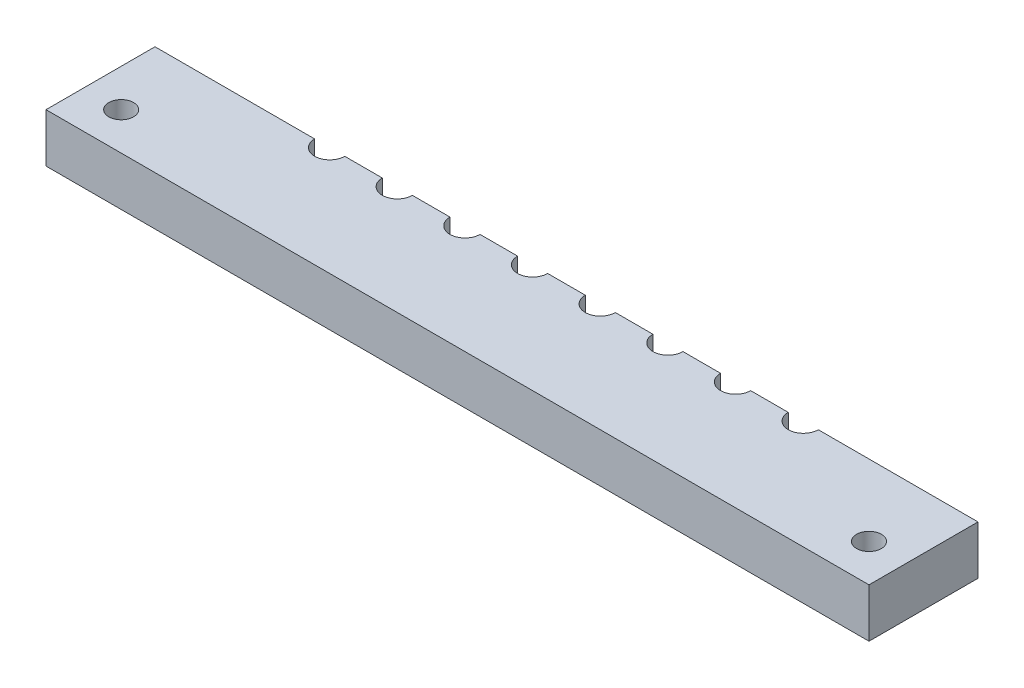
ISO-10303-21;
HEADER;
FILE_DESCRIPTION(('STEP AP214'),'2;1');
FILE_NAME('part.step','',(''),(''),'','','');
FILE_SCHEMA(('AUTOMOTIVE_DESIGN { 1 0 10303 214 1 1 1 1 }'));
ENDSEC;
DATA;
#1=APPLICATION_CONTEXT('core data for automotive mechanical design processes');
#2=APPLICATION_PROTOCOL_DEFINITION('international standard','automotive_design',2000,#1);
#3=PRODUCT_CONTEXT('',#1,'mechanical');
#4=PRODUCT('Part','Part','',(#3));
#5=PRODUCT_RELATED_PRODUCT_CATEGORY('part','',(#4));
#6=PRODUCT_DEFINITION_FORMATION('','',#4);
#7=PRODUCT_DEFINITION_CONTEXT('part definition',#1,'design');
#8=PRODUCT_DEFINITION('design','',#6,#7);
#9=PRODUCT_DEFINITION_SHAPE('','',#8);
#10=(LENGTH_UNIT() NAMED_UNIT(*) SI_UNIT(.MILLI.,.METRE.));
#11=(NAMED_UNIT(*) PLANE_ANGLE_UNIT() SI_UNIT($,.RADIAN.));
#12=(NAMED_UNIT(*) SI_UNIT($,.STERADIAN.) SOLID_ANGLE_UNIT());
#13=UNCERTAINTY_MEASURE_WITH_UNIT(LENGTH_MEASURE(1.E-05),#10,'distance_accuracy_value','');
#14=(GEOMETRIC_REPRESENTATION_CONTEXT(3) GLOBAL_UNCERTAINTY_ASSIGNED_CONTEXT((#13)) GLOBAL_UNIT_ASSIGNED_CONTEXT((#10,
#11,#12)) REPRESENTATION_CONTEXT('',''));
#15=CARTESIAN_POINT('',(0.,0.,0.));
#16=DIRECTION('',(0.,0.,1.));
#17=DIRECTION('',(1.,0.,0.));
#18=AXIS2_PLACEMENT_3D('',#15,#16,#17);
#19=CARTESIAN_POINT('',(0.,0.,0.));
#20=DIRECTION('',(0.,0.,1.));
#21=DIRECTION('',(1.,0.,0.));
#22=AXIS2_PLACEMENT_3D('',#19,#20,#21);
#23=PLANE('',#22);
#24=DIRECTION('',(-1.,0.,0.));
#25=VECTOR('',#24,1.);
#26=CARTESIAN_POINT('',(0.,-22.175,0.));
#27=LINE('',#26,#25);
#28=CARTESIAN_POINT('',(-34.225,-22.175,0.));
#29=VERTEX_POINT('',#28);
#30=CARTESIAN_POINT('',(-54.74,-22.175,0.));
#31=VERTEX_POINT('',#30);
#32=EDGE_CURVE('E326',#29,#31,#27,.T.);
#33=ORIENTED_EDGE('',*,*,#32,.T.);
#34=DIRECTION('',(0.,1.,0.));
#35=VECTOR('',#34,1.);
#36=CARTESIAN_POINT('',(-54.74,0.,0.));
#37=LINE('',#36,#35);
#38=CARTESIAN_POINT('',(-54.74,-15.675,0.));
#39=VERTEX_POINT('',#38);
#40=EDGE_CURVE('E38',#31,#39,#37,.T.);
#41=ORIENTED_EDGE('',*,*,#40,.T.);
#42=DIRECTION('',(1.,0.,0.));
#43=VECTOR('',#42,1.);
#44=CARTESIAN_POINT('',(0.,-15.675,0.));
#45=LINE('',#44,#43);
#46=CARTESIAN_POINT('',(-33.5,-15.675,0.));
#47=VERTEX_POINT('',#46);
#48=EDGE_CURVE('E45',#39,#47,#45,.T.);
#49=ORIENTED_EDGE('',*,*,#48,.T.);
#50=DIRECTION('',(0.,1.,0.));
#51=VECTOR('',#50,1.);
#52=CARTESIAN_POINT('',(-33.5,22.175,0.));
#53=LINE('',#52,#51);
#54=CARTESIAN_POINT('',(-33.5,-20.675,0.));
#55=VERTEX_POINT('',#54);
#56=EDGE_CURVE('E304',#55,#47,#53,.T.);
#57=ORIENTED_EDGE('',*,*,#56,.F.);
#58=DIRECTION('',(1.,0.,0.));
#59=VECTOR('',#58,1.);
#60=CARTESIAN_POINT('',(-34.225,-20.675,0.));
#61=LINE('',#60,#59);
#62=CARTESIAN_POINT('',(-34.225,-20.675,0.));
#63=VERTEX_POINT('',#62);
#64=EDGE_CURVE('E399',#63,#55,#61,.T.);
#65=ORIENTED_EDGE('',*,*,#64,.F.);
#66=DIRECTION('',(0.,1.,0.));
#67=VECTOR('',#66,1.);
#68=CARTESIAN_POINT('',(-34.225,22.175,0.));
#69=LINE('',#68,#67);
#70=EDGE_CURVE('E401',#29,#63,#69,.T.);
#71=ORIENTED_EDGE('',*,*,#70,.F.);
#72=EDGE_LOOP('',(#33,#41,#49,#57,#65,#71));
#73=FACE_BOUND('',#72,.T.);
#74=ADVANCED_FACE('F34',(#73),#23,.F.);
#75=CARTESIAN_POINT('',(-25.225,-22.175,0.));
#76=VERTEX_POINT('',#75);
#77=CARTESIAN_POINT('',(-28.775,-22.175,0.));
#78=VERTEX_POINT('',#77);
#79=EDGE_CURVE('E329',#76,#78,#27,.T.);
#80=ORIENTED_EDGE('',*,*,#79,.T.);
#81=DIRECTION('',(0.,1.,0.));
#82=VECTOR('',#81,1.);
#83=CARTESIAN_POINT('',(-28.775,22.175,0.));
#84=LINE('',#83,#82);
#85=CARTESIAN_POINT('',(-28.775,-20.675,0.));
#86=VERTEX_POINT('',#85);
#87=EDGE_CURVE('E402',#86,#78,#84,.F.);
#88=ORIENTED_EDGE('',*,*,#87,.F.);
#89=CARTESIAN_POINT('',(-29.5,-20.675,0.));
#90=VERTEX_POINT('',#89);
#91=EDGE_CURVE('E398',#90,#86,#61,.T.);
#92=ORIENTED_EDGE('',*,*,#91,.F.);
#93=DIRECTION('',(0.,1.,0.));
#94=VECTOR('',#93,1.);
#95=CARTESIAN_POINT('',(-29.5,22.175,0.));
#96=LINE('',#95,#94);
#97=CARTESIAN_POINT('',(-29.5,-15.675,0.));
#98=VERTEX_POINT('',#97);
#99=EDGE_CURVE('E396',#98,#90,#96,.F.);
#100=ORIENTED_EDGE('',*,*,#99,.F.);
#101=CARTESIAN_POINT('',(-24.5,-15.675,0.));
#102=VERTEX_POINT('',#101);
#103=EDGE_CURVE('E599',#98,#102,#45,.T.);
#104=ORIENTED_EDGE('',*,*,#103,.T.);
#105=DIRECTION('',(0.,1.,0.));
#106=VECTOR('',#105,1.);
#107=CARTESIAN_POINT('',(-24.5,22.175,0.));
#108=LINE('',#107,#106);
#109=CARTESIAN_POINT('',(-24.5,-20.675,0.));
#110=VERTEX_POINT('',#109);
#111=EDGE_CURVE('E388',#110,#102,#108,.T.);
#112=ORIENTED_EDGE('',*,*,#111,.F.);
#113=DIRECTION('',(1.,0.,0.));
#114=VECTOR('',#113,1.);
#115=CARTESIAN_POINT('',(-25.225,-20.675,0.));
#116=LINE('',#115,#114);
#117=CARTESIAN_POINT('',(-25.225,-20.675,0.));
#118=VERTEX_POINT('',#117);
#119=EDGE_CURVE('E389',#118,#110,#116,.T.);
#120=ORIENTED_EDGE('',*,*,#119,.F.);
#121=DIRECTION('',(0.,1.,0.));
#122=VECTOR('',#121,1.);
#123=CARTESIAN_POINT('',(-25.225,22.175,0.));
#124=LINE('',#123,#122);
#125=EDGE_CURVE('E391',#76,#118,#124,.T.);
#126=ORIENTED_EDGE('',*,*,#125,.F.);
#127=EDGE_LOOP('',(#80,#88,#92,#100,#104,#112,#120,#126));
#128=FACE_BOUND('',#127,.T.);
#129=ADVANCED_FACE('F530',(#128),#23,.F.);
#130=CARTESIAN_POINT('',(-16.225,-22.175,0.));
#131=VERTEX_POINT('',#130);
#132=CARTESIAN_POINT('',(-19.775,-22.175,0.));
#133=VERTEX_POINT('',#132);
#134=EDGE_CURVE('E546',#131,#133,#27,.T.);
#135=ORIENTED_EDGE('',*,*,#134,.T.);
#136=DIRECTION('',(0.,1.,0.));
#137=VECTOR('',#136,1.);
#138=CARTESIAN_POINT('',(-19.775,22.175,0.));
#139=LINE('',#138,#137);
#140=CARTESIAN_POINT('',(-19.775,-20.675,0.));
#141=VERTEX_POINT('',#140);
#142=EDGE_CURVE('E392',#141,#133,#139,.F.);
#143=ORIENTED_EDGE('',*,*,#142,.F.);
#144=CARTESIAN_POINT('',(-20.5,-20.675,0.));
#145=VERTEX_POINT('',#144);
#146=EDGE_CURVE('E387',#145,#141,#116,.T.);
#147=ORIENTED_EDGE('',*,*,#146,.F.);
#148=DIRECTION('',(0.,1.,0.));
#149=VECTOR('',#148,1.);
#150=CARTESIAN_POINT('',(-20.5,22.175,0.));
#151=LINE('',#150,#149);
#152=CARTESIAN_POINT('',(-20.5,-15.675,0.));
#153=VERTEX_POINT('',#152);
#154=EDGE_CURVE('E385',#153,#145,#151,.F.);
#155=ORIENTED_EDGE('',*,*,#154,.F.);
#156=CARTESIAN_POINT('',(-15.5,-15.675,0.));
#157=VERTEX_POINT('',#156);
#158=EDGE_CURVE('E595',#153,#157,#45,.T.);
#159=ORIENTED_EDGE('',*,*,#158,.T.);
#160=DIRECTION('',(0.,1.,0.));
#161=VECTOR('',#160,1.);
#162=CARTESIAN_POINT('',(-15.5,22.175,0.));
#163=LINE('',#162,#161);
#164=CARTESIAN_POINT('',(-15.5,-20.675,0.));
#165=VERTEX_POINT('',#164);
#166=EDGE_CURVE('E377',#165,#157,#163,.T.);
#167=ORIENTED_EDGE('',*,*,#166,.F.);
#168=DIRECTION('',(1.,0.,0.));
#169=VECTOR('',#168,1.);
#170=CARTESIAN_POINT('',(-16.225,-20.675,0.));
#171=LINE('',#170,#169);
#172=CARTESIAN_POINT('',(-16.225,-20.675,0.));
#173=VERTEX_POINT('',#172);
#174=EDGE_CURVE('E378',#173,#165,#171,.T.);
#175=ORIENTED_EDGE('',*,*,#174,.F.);
#176=DIRECTION('',(0.,1.,0.));
#177=VECTOR('',#176,1.);
#178=CARTESIAN_POINT('',(-16.225,22.175,0.));
#179=LINE('',#178,#177);
#180=EDGE_CURVE('E380',#131,#173,#179,.T.);
#181=ORIENTED_EDGE('',*,*,#180,.F.);
#182=EDGE_LOOP('',(#135,#143,#147,#155,#159,#167,#175,#181));
#183=FACE_BOUND('',#182,.T.);
#184=ADVANCED_FACE('F534',(#183),#23,.F.);
#185=CARTESIAN_POINT('',(-7.225,-22.175,0.));
#186=VERTEX_POINT('',#185);
#187=CARTESIAN_POINT('',(-10.775,-22.175,0.));
#188=VERTEX_POINT('',#187);
#189=EDGE_CURVE('E570',#186,#188,#27,.T.);
#190=ORIENTED_EDGE('',*,*,#189,.T.);
#191=DIRECTION('',(0.,1.,0.));
#192=VECTOR('',#191,1.);
#193=CARTESIAN_POINT('',(-10.775,22.175,0.));
#194=LINE('',#193,#192);
#195=CARTESIAN_POINT('',(-10.775,-20.675,0.));
#196=VERTEX_POINT('',#195);
#197=EDGE_CURVE('E381',#196,#188,#194,.F.);
#198=ORIENTED_EDGE('',*,*,#197,.F.);
#199=CARTESIAN_POINT('',(-11.5,-20.675,0.));
#200=VERTEX_POINT('',#199);
#201=EDGE_CURVE('E376',#200,#196,#171,.T.);
#202=ORIENTED_EDGE('',*,*,#201,.F.);
#203=DIRECTION('',(0.,1.,0.));
#204=VECTOR('',#203,1.);
#205=CARTESIAN_POINT('',(-11.5,22.175,0.));
#206=LINE('',#205,#204);
#207=CARTESIAN_POINT('',(-11.5,-15.675,0.));
#208=VERTEX_POINT('',#207);
#209=EDGE_CURVE('E374',#208,#200,#206,.F.);
#210=ORIENTED_EDGE('',*,*,#209,.F.);
#211=CARTESIAN_POINT('',(-6.5,-15.675,0.));
#212=VERTEX_POINT('',#211);
#213=EDGE_CURVE('E602',#208,#212,#45,.T.);
#214=ORIENTED_EDGE('',*,*,#213,.T.);
#215=DIRECTION('',(0.,1.,0.));
#216=VECTOR('',#215,1.);
#217=CARTESIAN_POINT('',(-6.50000000000002,22.175,0.));
#218=LINE('',#217,#216);
#219=CARTESIAN_POINT('',(-6.50000000000001,-20.675,0.));
#220=VERTEX_POINT('',#219);
#221=EDGE_CURVE('E366',#220,#212,#218,.T.);
#222=ORIENTED_EDGE('',*,*,#221,.F.);
#223=DIRECTION('',(1.,0.,0.));
#224=VECTOR('',#223,1.);
#225=CARTESIAN_POINT('',(-7.225,-20.675,0.));
#226=LINE('',#225,#224);
#227=CARTESIAN_POINT('',(-7.225,-20.675,0.));
#228=VERTEX_POINT('',#227);
#229=EDGE_CURVE('E367',#228,#220,#226,.T.);
#230=ORIENTED_EDGE('',*,*,#229,.F.);
#231=DIRECTION('',(0.,1.,0.));
#232=VECTOR('',#231,1.);
#233=CARTESIAN_POINT('',(-7.22500000000002,22.175,0.));
#234=LINE('',#233,#232);
#235=EDGE_CURVE('E369',#186,#228,#234,.T.);
#236=ORIENTED_EDGE('',*,*,#235,.F.);
#237=EDGE_LOOP('',(#190,#198,#202,#210,#214,#222,#230,#236));
#238=FACE_BOUND('',#237,.T.);
#239=ADVANCED_FACE('F539',(#238),#23,.F.);
#240=CARTESIAN_POINT('',(1.775,-22.175,0.));
#241=VERTEX_POINT('',#240);
#242=CARTESIAN_POINT('',(-1.77499999999999,-22.175,0.));
#243=VERTEX_POINT('',#242);
#244=EDGE_CURVE('E565',#241,#243,#27,.T.);
#245=ORIENTED_EDGE('',*,*,#244,.T.);
#246=DIRECTION('',(0.,1.,0.));
#247=VECTOR('',#246,1.);
#248=CARTESIAN_POINT('',(-1.77500000000001,22.175,0.));
#249=LINE('',#248,#247);
#250=CARTESIAN_POINT('',(-1.77499999999999,-20.675,0.));
#251=VERTEX_POINT('',#250);
#252=EDGE_CURVE('E370',#251,#243,#249,.F.);
#253=ORIENTED_EDGE('',*,*,#252,.F.);
#254=CARTESIAN_POINT('',(-2.49999999999998,-20.675,0.));
#255=VERTEX_POINT('',#254);
#256=EDGE_CURVE('E365',#255,#251,#226,.T.);
#257=ORIENTED_EDGE('',*,*,#256,.F.);
#258=DIRECTION('',(0.,1.,0.));
#259=VECTOR('',#258,1.);
#260=CARTESIAN_POINT('',(-2.50000000000002,22.175,0.));
#261=LINE('',#260,#259);
#262=CARTESIAN_POINT('',(-2.5,-15.675,0.));
#263=VERTEX_POINT('',#262);
#264=EDGE_CURVE('E363',#263,#255,#261,.F.);
#265=ORIENTED_EDGE('',*,*,#264,.F.);
#266=CARTESIAN_POINT('',(2.5,-15.675,0.));
#267=VERTEX_POINT('',#266);
#268=EDGE_CURVE('E604',#263,#267,#45,.T.);
#269=ORIENTED_EDGE('',*,*,#268,.T.);
#270=DIRECTION('',(0.,1.,0.));
#271=VECTOR('',#270,1.);
#272=CARTESIAN_POINT('',(2.49999999999998,22.175,0.));
#273=LINE('',#272,#271);
#274=CARTESIAN_POINT('',(2.49999999999999,-20.675,0.));
#275=VERTEX_POINT('',#274);
#276=EDGE_CURVE('E355',#275,#267,#273,.T.);
#277=ORIENTED_EDGE('',*,*,#276,.F.);
#278=DIRECTION('',(1.,0.,0.));
#279=VECTOR('',#278,1.);
#280=CARTESIAN_POINT('',(1.775,-20.675,0.));
#281=LINE('',#280,#279);
#282=CARTESIAN_POINT('',(1.775,-20.675,0.));
#283=VERTEX_POINT('',#282);
#284=EDGE_CURVE('E356',#283,#275,#281,.T.);
#285=ORIENTED_EDGE('',*,*,#284,.F.);
#286=DIRECTION('',(0.,1.,0.));
#287=VECTOR('',#286,1.);
#288=CARTESIAN_POINT('',(1.77499999999998,22.175,0.));
#289=LINE('',#288,#287);
#290=EDGE_CURVE('E358',#241,#283,#289,.T.);
#291=ORIENTED_EDGE('',*,*,#290,.F.);
#292=EDGE_LOOP('',(#245,#253,#257,#265,#269,#277,#285,#291));
#293=FACE_BOUND('',#292,.T.);
#294=ADVANCED_FACE('F833',(#293),#23,.F.);
#295=CARTESIAN_POINT('',(10.775,-22.175,0.));
#296=VERTEX_POINT('',#295);
#297=CARTESIAN_POINT('',(7.22500000000001,-22.175,0.));
#298=VERTEX_POINT('',#297);
#299=EDGE_CURVE('E560',#296,#298,#27,.T.);
#300=ORIENTED_EDGE('',*,*,#299,.T.);
#301=DIRECTION('',(0.,1.,0.));
#302=VECTOR('',#301,1.);
#303=CARTESIAN_POINT('',(7.22499999999999,22.175,0.));
#304=LINE('',#303,#302);
#305=CARTESIAN_POINT('',(7.22500000000001,-20.675,0.));
#306=VERTEX_POINT('',#305);
#307=EDGE_CURVE('E359',#306,#298,#304,.F.);
#308=ORIENTED_EDGE('',*,*,#307,.F.);
#309=CARTESIAN_POINT('',(6.50000000000002,-20.675,0.));
#310=VERTEX_POINT('',#309);
#311=EDGE_CURVE('E354',#310,#306,#281,.T.);
#312=ORIENTED_EDGE('',*,*,#311,.F.);
#313=DIRECTION('',(0.,1.,0.));
#314=VECTOR('',#313,1.);
#315=CARTESIAN_POINT('',(6.49999999999998,22.175,0.));
#316=LINE('',#315,#314);
#317=CARTESIAN_POINT('',(6.5,-15.675,0.));
#318=VERTEX_POINT('',#317);
#319=EDGE_CURVE('E352',#318,#310,#316,.F.);
#320=ORIENTED_EDGE('',*,*,#319,.F.);
#321=CARTESIAN_POINT('',(11.5,-15.675,0.));
#322=VERTEX_POINT('',#321);
#323=EDGE_CURVE('E1031',#318,#322,#45,.T.);
#324=ORIENTED_EDGE('',*,*,#323,.T.);
#325=DIRECTION('',(0.,1.,0.));
#326=VECTOR('',#325,1.);
#327=CARTESIAN_POINT('',(11.5,22.175,0.));
#328=LINE('',#327,#326);
#329=CARTESIAN_POINT('',(11.5,-20.675,0.));
#330=VERTEX_POINT('',#329);
#331=EDGE_CURVE('E344',#330,#322,#328,.T.);
#332=ORIENTED_EDGE('',*,*,#331,.F.);
#333=DIRECTION('',(1.,0.,0.));
#334=VECTOR('',#333,1.);
#335=CARTESIAN_POINT('',(10.775,-20.675,0.));
#336=LINE('',#335,#334);
#337=CARTESIAN_POINT('',(10.775,-20.675,0.));
#338=VERTEX_POINT('',#337);
#339=EDGE_CURVE('E345',#338,#330,#336,.T.);
#340=ORIENTED_EDGE('',*,*,#339,.F.);
#341=DIRECTION('',(0.,1.,0.));
#342=VECTOR('',#341,1.);
#343=CARTESIAN_POINT('',(10.775,22.175,0.));
#344=LINE('',#343,#342);
#345=EDGE_CURVE('E347',#296,#338,#344,.T.);
#346=ORIENTED_EDGE('',*,*,#345,.F.);
#347=EDGE_LOOP('',(#300,#308,#312,#320,#324,#332,#340,#346));
#348=FACE_BOUND('',#347,.T.);
#349=ADVANCED_FACE('F825',(#348),#23,.F.);
#350=CARTESIAN_POINT('',(19.775,-22.175,0.));
#351=VERTEX_POINT('',#350);
#352=CARTESIAN_POINT('',(16.225,-22.175,0.));
#353=VERTEX_POINT('',#352);
#354=EDGE_CURVE('E556',#351,#353,#27,.T.);
#355=ORIENTED_EDGE('',*,*,#354,.T.);
#356=DIRECTION('',(0.,1.,0.));
#357=VECTOR('',#356,1.);
#358=CARTESIAN_POINT('',(16.225,22.175,0.));
#359=LINE('',#358,#357);
#360=CARTESIAN_POINT('',(16.225,-20.675,0.));
#361=VERTEX_POINT('',#360);
#362=EDGE_CURVE('E348',#361,#353,#359,.F.);
#363=ORIENTED_EDGE('',*,*,#362,.F.);
#364=CARTESIAN_POINT('',(15.5,-20.675,0.));
#365=VERTEX_POINT('',#364);
#366=EDGE_CURVE('E343',#365,#361,#336,.T.);
#367=ORIENTED_EDGE('',*,*,#366,.F.);
#368=DIRECTION('',(0.,1.,0.));
#369=VECTOR('',#368,1.);
#370=CARTESIAN_POINT('',(15.5,22.175,0.));
#371=LINE('',#370,#369);
#372=CARTESIAN_POINT('',(15.5,-15.675,0.));
#373=VERTEX_POINT('',#372);
#374=EDGE_CURVE('E341',#373,#365,#371,.F.);
#375=ORIENTED_EDGE('',*,*,#374,.F.);
#376=CARTESIAN_POINT('',(20.5,-15.675,0.));
#377=VERTEX_POINT('',#376);
#378=EDGE_CURVE('E1029',#373,#377,#45,.T.);
#379=ORIENTED_EDGE('',*,*,#378,.T.);
#380=DIRECTION('',(0.,1.,0.));
#381=VECTOR('',#380,1.);
#382=CARTESIAN_POINT('',(20.5,22.175,0.));
#383=LINE('',#382,#381);
#384=CARTESIAN_POINT('',(20.5,-20.675,0.));
#385=VERTEX_POINT('',#384);
#386=EDGE_CURVE('E333',#385,#377,#383,.T.);
#387=ORIENTED_EDGE('',*,*,#386,.F.);
#388=DIRECTION('',(1.,0.,0.));
#389=VECTOR('',#388,1.);
#390=CARTESIAN_POINT('',(19.775,-20.675,0.));
#391=LINE('',#390,#389);
#392=CARTESIAN_POINT('',(19.775,-20.675,0.));
#393=VERTEX_POINT('',#392);
#394=EDGE_CURVE('E334',#393,#385,#391,.T.);
#395=ORIENTED_EDGE('',*,*,#394,.F.);
#396=DIRECTION('',(0.,1.,0.));
#397=VECTOR('',#396,1.);
#398=CARTESIAN_POINT('',(19.775,22.175,0.));
#399=LINE('',#398,#397);
#400=EDGE_CURVE('E336',#351,#393,#399,.T.);
#401=ORIENTED_EDGE('',*,*,#400,.F.);
#402=EDGE_LOOP('',(#355,#363,#367,#375,#379,#387,#395,#401));
#403=FACE_BOUND('',#402,.T.);
#404=ADVANCED_FACE('F817',(#403),#23,.F.);
#405=CARTESIAN_POINT('',(28.775,-22.175,0.));
#406=VERTEX_POINT('',#405);
#407=CARTESIAN_POINT('',(25.225,-22.175,0.));
#408=VERTEX_POINT('',#407);
#409=EDGE_CURVE('E554',#406,#408,#27,.T.);
#410=ORIENTED_EDGE('',*,*,#409,.T.);
#411=DIRECTION('',(0.,1.,0.));
#412=VECTOR('',#411,1.);
#413=CARTESIAN_POINT('',(25.225,22.175,0.));
#414=LINE('',#413,#412);
#415=CARTESIAN_POINT('',(25.225,-20.675,0.));
#416=VERTEX_POINT('',#415);
#417=EDGE_CURVE('E337',#416,#408,#414,.F.);
#418=ORIENTED_EDGE('',*,*,#417,.F.);
#419=CARTESIAN_POINT('',(24.5,-20.675,0.));
#420=VERTEX_POINT('',#419);
#421=EDGE_CURVE('E332',#420,#416,#391,.T.);
#422=ORIENTED_EDGE('',*,*,#421,.F.);
#423=DIRECTION('',(0.,1.,0.));
#424=VECTOR('',#423,1.);
#425=CARTESIAN_POINT('',(24.5,22.175,0.));
#426=LINE('',#425,#424);
#427=CARTESIAN_POINT('',(24.5,-15.675,0.));
#428=VERTEX_POINT('',#427);
#429=EDGE_CURVE('E330',#428,#420,#426,.F.);
#430=ORIENTED_EDGE('',*,*,#429,.F.);
#431=CARTESIAN_POINT('',(29.5,-15.675,0.));
#432=VERTEX_POINT('',#431);
#433=EDGE_CURVE('E43',#428,#432,#45,.T.);
#434=ORIENTED_EDGE('',*,*,#433,.T.);
#435=DIRECTION('',(0.,1.,0.));
#436=VECTOR('',#435,1.);
#437=CARTESIAN_POINT('',(29.5,22.175,0.));
#438=LINE('',#437,#436);
#439=CARTESIAN_POINT('',(29.5,-20.675,0.));
#440=VERTEX_POINT('',#439);
#441=EDGE_CURVE('E318',#440,#432,#438,.T.);
#442=ORIENTED_EDGE('',*,*,#441,.F.);
#443=DIRECTION('',(1.,0.,0.));
#444=VECTOR('',#443,1.);
#445=CARTESIAN_POINT('',(28.775,-20.675,0.));
#446=LINE('',#445,#444);
#447=CARTESIAN_POINT('',(28.775,-20.675,0.));
#448=VERTEX_POINT('',#447);
#449=EDGE_CURVE('E319',#448,#440,#446,.T.);
#450=ORIENTED_EDGE('',*,*,#449,.F.);
#451=DIRECTION('',(0.,1.,0.));
#452=VECTOR('',#451,1.);
#453=CARTESIAN_POINT('',(28.775,22.175,0.));
#454=LINE('',#453,#452);
#455=EDGE_CURVE('E321',#406,#448,#454,.T.);
#456=ORIENTED_EDGE('',*,*,#455,.F.);
#457=EDGE_LOOP('',(#410,#418,#422,#430,#434,#442,#450,#456));
#458=FACE_BOUND('',#457,.T.);
#459=ADVANCED_FACE('F527',(#458),#23,.F.);
#460=CARTESIAN_POINT('',(54.74,-22.175,0.));
#461=VERTEX_POINT('',#460);
#462=CARTESIAN_POINT('',(34.225,-22.175,0.));
#463=VERTEX_POINT('',#462);
#464=EDGE_CURVE('E325',#461,#463,#27,.T.);
#465=ORIENTED_EDGE('',*,*,#464,.T.);
#466=DIRECTION('',(0.,1.,0.));
#467=VECTOR('',#466,1.);
#468=CARTESIAN_POINT('',(34.225,22.175,0.));
#469=LINE('',#468,#467);
#470=CARTESIAN_POINT('',(34.225,-20.675,0.));
#471=VERTEX_POINT('',#470);
#472=EDGE_CURVE('E322',#471,#463,#469,.F.);
#473=ORIENTED_EDGE('',*,*,#472,.F.);
#474=CARTESIAN_POINT('',(33.5,-20.675,0.));
#475=VERTEX_POINT('',#474);
#476=EDGE_CURVE('E317',#475,#471,#446,.T.);
#477=ORIENTED_EDGE('',*,*,#476,.F.);
#478=DIRECTION('',(0.,1.,0.));
#479=VECTOR('',#478,1.);
#480=CARTESIAN_POINT('',(33.5,22.175,0.));
#481=LINE('',#480,#479);
#482=CARTESIAN_POINT('',(33.5,-15.675,0.));
#483=VERTEX_POINT('',#482);
#484=EDGE_CURVE('E315',#483,#475,#481,.F.);
#485=ORIENTED_EDGE('',*,*,#484,.F.);
#486=CARTESIAN_POINT('',(54.74,-15.675,0.));
#487=VERTEX_POINT('',#486);
#488=EDGE_CURVE('E11',#483,#487,#45,.T.);
#489=ORIENTED_EDGE('',*,*,#488,.T.);
#490=DIRECTION('',(0.,1.,0.));
#491=VECTOR('',#490,1.);
#492=CARTESIAN_POINT('',(54.74,0.,0.));
#493=LINE('',#492,#491);
#494=EDGE_CURVE('E59',#461,#487,#493,.T.);
#495=ORIENTED_EDGE('',*,*,#494,.F.);
#496=EDGE_LOOP('',(#465,#473,#477,#485,#489,#495));
#497=FACE_BOUND('',#496,.T.);
#498=ADVANCED_FACE('F36',(#497),#23,.F.);
#499=CARTESIAN_POINT('',(0.,-22.175,14.5));
#500=DIRECTION('',(0.,-1.,0.));
#501=DIRECTION('',(1.,0.,0.));
#502=AXIS2_PLACEMENT_3D('',#499,#500,#501);
#503=PLANE('',#502);
#504=ORIENTED_EDGE('',*,*,#464,.F.);
#505=DIRECTION('',(0.,0.,-1.));
#506=VECTOR('',#505,1.);
#507=CARTESIAN_POINT('',(54.74,-22.175,14.5));
#508=LINE('',#507,#506);
#509=CARTESIAN_POINT('',(54.74,-22.175,14.5));
#510=VERTEX_POINT('',#509);
#511=EDGE_CURVE('E299',#510,#461,#508,.T.);
#512=ORIENTED_EDGE('',*,*,#511,.F.);
#513=DIRECTION('',(-1.,0.,0.));
#514=VECTOR('',#513,1.);
#515=CARTESIAN_POINT('',(0.,-22.175,14.5));
#516=LINE('',#515,#514);
#517=CARTESIAN_POINT('',(-54.74,-22.175,14.5));
#518=VERTEX_POINT('',#517);
#519=EDGE_CURVE('E288',#510,#518,#516,.T.);
#520=ORIENTED_EDGE('',*,*,#519,.T.);
#521=DIRECTION('',(0.,0.,-1.));
#522=VECTOR('',#521,1.);
#523=CARTESIAN_POINT('',(-54.74,-22.175,14.5));
#524=LINE('',#523,#522);
#525=EDGE_CURVE('E301',#518,#31,#524,.T.);
#526=ORIENTED_EDGE('',*,*,#525,.T.);
#527=ORIENTED_EDGE('',*,*,#32,.F.);
#528=CARTESIAN_POINT('',(-31.5,-22.175,0.));
#529=DIRECTION('',(0.,1.,0.));
#530=DIRECTION('',(-1.,0.,0.));
#531=AXIS2_PLACEMENT_3D('',#528,#529,#530);
#532=CIRCLE('',#531,2.725);
#533=EDGE_CURVE('E290',#29,#78,#532,.T.);
#534=ORIENTED_EDGE('',*,*,#533,.T.);
#535=ORIENTED_EDGE('',*,*,#79,.F.);
#536=CARTESIAN_POINT('',(-22.5,-22.175,0.));
#537=DIRECTION('',(0.,1.,0.));
#538=DIRECTION('',(-1.,0.,0.));
#539=AXIS2_PLACEMENT_3D('',#536,#537,#538);
#540=CIRCLE('',#539,2.725);
#541=EDGE_CURVE('E422',#76,#133,#540,.T.);
#542=ORIENTED_EDGE('',*,*,#541,.T.);
#543=ORIENTED_EDGE('',*,*,#134,.F.);
#544=CARTESIAN_POINT('',(-13.5,-22.175,0.));
#545=DIRECTION('',(0.,1.,0.));
#546=DIRECTION('',(-1.,0.,0.));
#547=AXIS2_PLACEMENT_3D('',#544,#545,#546);
#548=CIRCLE('',#547,2.725);
#549=EDGE_CURVE('E433',#131,#188,#548,.T.);
#550=ORIENTED_EDGE('',*,*,#549,.T.);
#551=ORIENTED_EDGE('',*,*,#189,.F.);
#552=CARTESIAN_POINT('',(-4.5,-22.175,0.));
#553=DIRECTION('',(0.,1.,0.));
#554=DIRECTION('',(-1.,0.,0.));
#555=AXIS2_PLACEMENT_3D('',#552,#553,#554);
#556=CIRCLE('',#555,2.725);
#557=EDGE_CURVE('E442',#186,#243,#556,.T.);
#558=ORIENTED_EDGE('',*,*,#557,.T.);
#559=ORIENTED_EDGE('',*,*,#244,.F.);
#560=CARTESIAN_POINT('',(4.5,-22.175,0.));
#561=DIRECTION('',(0.,1.,0.));
#562=DIRECTION('',(-1.,0.,0.));
#563=AXIS2_PLACEMENT_3D('',#560,#561,#562);
#564=CIRCLE('',#563,2.725);
#565=EDGE_CURVE('E451',#241,#298,#564,.T.);
#566=ORIENTED_EDGE('',*,*,#565,.T.);
#567=ORIENTED_EDGE('',*,*,#299,.F.);
#568=CARTESIAN_POINT('',(13.5,-22.175,0.));
#569=DIRECTION('',(0.,1.,0.));
#570=DIRECTION('',(-1.,0.,0.));
#571=AXIS2_PLACEMENT_3D('',#568,#569,#570);
#572=CIRCLE('',#571,2.725);
#573=EDGE_CURVE('E460',#296,#353,#572,.T.);
#574=ORIENTED_EDGE('',*,*,#573,.T.);
#575=ORIENTED_EDGE('',*,*,#354,.F.);
#576=CARTESIAN_POINT('',(22.5,-22.175,0.));
#577=DIRECTION('',(0.,1.,0.));
#578=DIRECTION('',(-1.,0.,0.));
#579=AXIS2_PLACEMENT_3D('',#576,#577,#578);
#580=CIRCLE('',#579,2.725);
#581=EDGE_CURVE('E469',#351,#408,#580,.T.);
#582=ORIENTED_EDGE('',*,*,#581,.T.);
#583=ORIENTED_EDGE('',*,*,#409,.F.);
#584=CARTESIAN_POINT('',(31.5,-22.175,0.));
#585=DIRECTION('',(0.,1.,0.));
#586=DIRECTION('',(-1.,0.,0.));
#587=AXIS2_PLACEMENT_3D('',#584,#585,#586);
#588=CIRCLE('',#587,2.725);
#589=EDGE_CURVE('E478',#406,#463,#588,.T.);
#590=ORIENTED_EDGE('',*,*,#589,.T.);
#591=EDGE_LOOP('',(#504,#512,#520,#526,#527,#534,#535,#542,#543,#550,#551,#558,#559,#566,#567,
#574,#575,#582,#583,#590));
#592=FACE_BOUND('',#591,.T.);
#593=CARTESIAN_POINT('',(49.74,-22.175,9.5));
#594=DIRECTION('',(0.,1.,0.));
#595=DIRECTION('',(-1.,0.,0.));
#596=AXIS2_PLACEMENT_3D('',#593,#594,#595);
#597=CIRCLE('',#596,1.65);
#598=CARTESIAN_POINT('',(48.09,-22.175,9.5));
#599=VERTEX_POINT('',#598);
#600=EDGE_CURVE('E312',#599,#599,#597,.T.);
#601=ORIENTED_EDGE('',*,*,#600,.T.);
#602=EDGE_LOOP('',(#601));
#603=FACE_BOUND('',#602,.T.);
#604=CARTESIAN_POINT('',(-49.74,-22.175,9.5));
#605=DIRECTION('',(0.,1.,0.));
#606=DIRECTION('',(1.,0.,0.));
#607=AXIS2_PLACEMENT_3D('',#604,#605,#606);
#608=CIRCLE('',#607,1.65);
#609=CARTESIAN_POINT('',(-48.09,-22.175,9.5));
#610=VERTEX_POINT('',#609);
#611=EDGE_CURVE('E507',#610,#610,#608,.T.);
#612=ORIENTED_EDGE('',*,*,#611,.T.);
#613=EDGE_LOOP('',(#612));
#614=FACE_BOUND('',#613,.T.);
#615=ADVANCED_FACE('F513',(#592,#603,#614),#503,.T.);
#616=CARTESIAN_POINT('',(0.,0.,14.5));
#617=DIRECTION('',(0.,0.,1.));
#618=DIRECTION('',(1.,0.,0.));
#619=AXIS2_PLACEMENT_3D('',#616,#617,#618);
#620=PLANE('',#619);
#621=DIRECTION('',(0.,1.,0.));
#622=VECTOR('',#621,1.);
#623=CARTESIAN_POINT('',(54.74,0.,14.5));
#624=LINE('',#623,#622);
#625=CARTESIAN_POINT('',(54.74,-15.675,14.5));
#626=VERTEX_POINT('',#625);
#627=EDGE_CURVE('E283',#510,#626,#624,.T.);
#628=ORIENTED_EDGE('',*,*,#627,.T.);
#629=DIRECTION('',(1.,0.,0.));
#630=VECTOR('',#629,1.);
#631=CARTESIAN_POINT('',(0.,-15.675,14.5));
#632=LINE('',#631,#630);
#633=CARTESIAN_POINT('',(-54.74,-15.675,14.5));
#634=VERTEX_POINT('',#633);
#635=EDGE_CURVE('E269',#634,#626,#632,.T.);
#636=ORIENTED_EDGE('',*,*,#635,.F.);
#637=DIRECTION('',(0.,1.,0.));
#638=VECTOR('',#637,1.);
#639=CARTESIAN_POINT('',(-54.74,0.,14.5));
#640=LINE('',#639,#638);
#641=EDGE_CURVE('E289',#518,#634,#640,.T.);
#642=ORIENTED_EDGE('',*,*,#641,.F.);
#643=ORIENTED_EDGE('',*,*,#519,.F.);
#644=EDGE_LOOP('',(#628,#636,#642,#643));
#645=FACE_BOUND('',#644,.T.);
#646=ADVANCED_FACE('F286',(#645),#620,.T.);
#647=CARTESIAN_POINT('',(-54.74,0.,14.5));
#648=DIRECTION('',(-1.,0.,0.));
#649=DIRECTION('',(0.,0.,1.));
#650=AXIS2_PLACEMENT_3D('',#647,#648,#649);
#651=PLANE('',#650);
#652=ORIENTED_EDGE('',*,*,#40,.F.);
#653=ORIENTED_EDGE('',*,*,#525,.F.);
#654=ORIENTED_EDGE('',*,*,#641,.T.);
#655=DIRECTION('',(0.,0.,-1.));
#656=VECTOR('',#655,1.);
#657=CARTESIAN_POINT('',(-54.74,-15.675,14.5));
#658=LINE('',#657,#656);
#659=EDGE_CURVE('E274',#634,#39,#658,.T.);
#660=ORIENTED_EDGE('',*,*,#659,.T.);
#661=EDGE_LOOP('',(#652,#653,#654,#660));
#662=FACE_BOUND('',#661,.T.);
#663=ADVANCED_FACE('F549',(#662),#651,.T.);
#664=CARTESIAN_POINT('',(54.74,0.,14.5));
#665=DIRECTION('',(-1.,0.,0.));
#666=DIRECTION('',(0.,0.,1.));
#667=AXIS2_PLACEMENT_3D('',#664,#665,#666);
#668=PLANE('',#667);
#669=ORIENTED_EDGE('',*,*,#511,.T.);
#670=ORIENTED_EDGE('',*,*,#494,.T.);
#671=DIRECTION('',(0.,0.,-1.));
#672=VECTOR('',#671,1.);
#673=CARTESIAN_POINT('',(54.74,-15.675,14.5));
#674=LINE('',#673,#672);
#675=EDGE_CURVE('E272',#626,#487,#674,.T.);
#676=ORIENTED_EDGE('',*,*,#675,.F.);
#677=ORIENTED_EDGE('',*,*,#627,.F.);
#678=EDGE_LOOP('',(#669,#670,#676,#677));
#679=FACE_BOUND('',#678,.T.);
#680=ADVANCED_FACE('F282',(#679),#668,.F.);
#681=CARTESIAN_POINT('',(31.5,22.175,0.));
#682=DIRECTION('',(0.,1.,0.));
#683=DIRECTION('',(-1.,0.,0.));
#684=AXIS2_PLACEMENT_3D('',#681,#682,#683);
#685=CYLINDRICAL_SURFACE('',#684,2.725);
#686=CARTESIAN_POINT('',(31.5,-20.675,0.));
#687=DIRECTION('',(0.,1.,0.));
#688=DIRECTION('',(-1.,0.,0.));
#689=AXIS2_PLACEMENT_3D('',#686,#687,#688);
#690=CIRCLE('',#689,2.725);
#691=EDGE_CURVE('E481',#448,#471,#690,.T.);
#692=ORIENTED_EDGE('',*,*,#691,.T.);
#693=ORIENTED_EDGE('',*,*,#472,.T.);
#694=ORIENTED_EDGE('',*,*,#589,.F.);
#695=ORIENTED_EDGE('',*,*,#455,.T.);
#696=EDGE_LOOP('',(#692,#693,#694,#695));
#697=FACE_BOUND('',#696,.T.);
#698=ADVANCED_FACE('F627',(#697),#685,.F.);
#699=CARTESIAN_POINT('',(28.775,-20.675,0.));
#700=DIRECTION('',(0.,1.,0.));
#701=DIRECTION('',(-1.,0.,0.));
#702=AXIS2_PLACEMENT_3D('',#699,#700,#701);
#703=PLANE('',#702);
#704=ORIENTED_EDGE('',*,*,#691,.F.);
#705=ORIENTED_EDGE('',*,*,#449,.T.);
#706=CARTESIAN_POINT('',(31.5,-20.675,0.));
#707=DIRECTION('',(0.,1.,0.));
#708=DIRECTION('',(-1.,0.,0.));
#709=AXIS2_PLACEMENT_3D('',#706,#707,#708);
#710=CIRCLE('',#709,2.00000000000001);
#711=EDGE_CURVE('E484',#440,#475,#710,.T.);
#712=ORIENTED_EDGE('',*,*,#711,.T.);
#713=ORIENTED_EDGE('',*,*,#476,.T.);
#714=EDGE_LOOP('',(#704,#705,#712,#713));
#715=FACE_BOUND('',#714,.T.);
#716=ADVANCED_FACE('F631',(#715),#703,.F.);
#717=CARTESIAN_POINT('',(31.5,22.175,0.));
#718=DIRECTION('',(0.,1.,0.));
#719=DIRECTION('',(-1.,0.,0.));
#720=AXIS2_PLACEMENT_3D('',#717,#718,#719);
#721=CYLINDRICAL_SURFACE('',#720,2.);
#722=CARTESIAN_POINT('',(31.5,-15.675,0.));
#723=DIRECTION('',(0.,1.,0.));
#724=DIRECTION('',(0.,0.,1.));
#725=AXIS2_PLACEMENT_3D('',#722,#723,#724);
#726=CIRCLE('',#725,2.);
#727=EDGE_CURVE('E305',#483,#432,#726,.F.);
#728=ORIENTED_EDGE('',*,*,#727,.F.);
#729=ORIENTED_EDGE('',*,*,#484,.T.);
#730=ORIENTED_EDGE('',*,*,#711,.F.);
#731=ORIENTED_EDGE('',*,*,#441,.T.);
#732=EDGE_LOOP('',(#728,#729,#730,#731));
#733=FACE_BOUND('',#732,.T.);
#734=ADVANCED_FACE('F637',(#733),#721,.F.);
#735=CARTESIAN_POINT('',(22.5,22.175,0.));
#736=DIRECTION('',(0.,1.,0.));
#737=DIRECTION('',(-1.,0.,0.));
#738=AXIS2_PLACEMENT_3D('',#735,#736,#737);
#739=CYLINDRICAL_SURFACE('',#738,2.725);
#740=CARTESIAN_POINT('',(22.5,-20.675,0.));
#741=DIRECTION('',(0.,1.,0.));
#742=DIRECTION('',(-1.,0.,0.));
#743=AXIS2_PLACEMENT_3D('',#740,#741,#742);
#744=CIRCLE('',#743,2.725);
#745=EDGE_CURVE('E472',#393,#416,#744,.T.);
#746=ORIENTED_EDGE('',*,*,#745,.T.);
#747=ORIENTED_EDGE('',*,*,#417,.T.);
#748=ORIENTED_EDGE('',*,*,#581,.F.);
#749=ORIENTED_EDGE('',*,*,#400,.T.);
#750=EDGE_LOOP('',(#746,#747,#748,#749));
#751=FACE_BOUND('',#750,.T.);
#752=ADVANCED_FACE('F650',(#751),#739,.F.);
#753=CARTESIAN_POINT('',(19.775,-20.675,0.));
#754=DIRECTION('',(0.,1.,0.));
#755=DIRECTION('',(-1.,0.,0.));
#756=AXIS2_PLACEMENT_3D('',#753,#754,#755);
#757=PLANE('',#756);
#758=ORIENTED_EDGE('',*,*,#745,.F.);
#759=ORIENTED_EDGE('',*,*,#394,.T.);
#760=CARTESIAN_POINT('',(22.5,-20.675,0.));
#761=DIRECTION('',(0.,1.,0.));
#762=DIRECTION('',(-1.,0.,0.));
#763=AXIS2_PLACEMENT_3D('',#760,#761,#762);
#764=CIRCLE('',#763,2.00000000000001);
#765=EDGE_CURVE('E475',#385,#420,#764,.T.);
#766=ORIENTED_EDGE('',*,*,#765,.T.);
#767=ORIENTED_EDGE('',*,*,#421,.T.);
#768=EDGE_LOOP('',(#758,#759,#766,#767));
#769=FACE_BOUND('',#768,.T.);
#770=ADVANCED_FACE('F646',(#769),#757,.F.);
#771=CARTESIAN_POINT('',(22.5,22.175,0.));
#772=DIRECTION('',(0.,1.,0.));
#773=DIRECTION('',(-1.,0.,0.));
#774=AXIS2_PLACEMENT_3D('',#771,#772,#773);
#775=CYLINDRICAL_SURFACE('',#774,2.);
#776=CARTESIAN_POINT('',(22.5,-15.675,0.));
#777=DIRECTION('',(0.,1.,0.));
#778=DIRECTION('',(0.,0.,1.));
#779=AXIS2_PLACEMENT_3D('',#776,#777,#778);
#780=CIRCLE('',#779,2.);
#781=EDGE_CURVE('E308',#428,#377,#780,.F.);
#782=ORIENTED_EDGE('',*,*,#781,.F.);
#783=ORIENTED_EDGE('',*,*,#429,.T.);
#784=ORIENTED_EDGE('',*,*,#765,.F.);
#785=ORIENTED_EDGE('',*,*,#386,.T.);
#786=EDGE_LOOP('',(#782,#783,#784,#785));
#787=FACE_BOUND('',#786,.T.);
#788=ADVANCED_FACE('F642',(#787),#775,.F.);
#789=CARTESIAN_POINT('',(13.5,22.175,0.));
#790=DIRECTION('',(0.,1.,0.));
#791=DIRECTION('',(-1.,0.,0.));
#792=AXIS2_PLACEMENT_3D('',#789,#790,#791);
#793=CYLINDRICAL_SURFACE('',#792,2.725);
#794=CARTESIAN_POINT('',(13.5,-20.675,0.));
#795=DIRECTION('',(0.,1.,0.));
#796=DIRECTION('',(-1.,0.,0.));
#797=AXIS2_PLACEMENT_3D('',#794,#795,#796);
#798=CIRCLE('',#797,2.725);
#799=EDGE_CURVE('E463',#338,#361,#798,.T.);
#800=ORIENTED_EDGE('',*,*,#799,.T.);
#801=ORIENTED_EDGE('',*,*,#362,.T.);
#802=ORIENTED_EDGE('',*,*,#573,.F.);
#803=ORIENTED_EDGE('',*,*,#345,.T.);
#804=EDGE_LOOP('',(#800,#801,#802,#803));
#805=FACE_BOUND('',#804,.T.);
#806=ADVANCED_FACE('F645',(#805),#793,.F.);
#807=CARTESIAN_POINT('',(10.775,-20.675,0.));
#808=DIRECTION('',(0.,1.,0.));
#809=DIRECTION('',(-1.,0.,0.));
#810=AXIS2_PLACEMENT_3D('',#807,#808,#809);
#811=PLANE('',#810);
#812=ORIENTED_EDGE('',*,*,#799,.F.);
#813=ORIENTED_EDGE('',*,*,#339,.T.);
#814=CARTESIAN_POINT('',(13.5,-20.675,0.));
#815=DIRECTION('',(0.,1.,0.));
#816=DIRECTION('',(-1.,0.,0.));
#817=AXIS2_PLACEMENT_3D('',#814,#815,#816);
#818=CIRCLE('',#817,2.00000000000001);
#819=EDGE_CURVE('E466',#330,#365,#818,.T.);
#820=ORIENTED_EDGE('',*,*,#819,.T.);
#821=ORIENTED_EDGE('',*,*,#366,.T.);
#822=EDGE_LOOP('',(#812,#813,#820,#821));
#823=FACE_BOUND('',#822,.T.);
#824=ADVANCED_FACE('F659',(#823),#811,.F.);
#825=CARTESIAN_POINT('',(13.5,22.175,0.));
#826=DIRECTION('',(0.,1.,0.));
#827=DIRECTION('',(-1.,0.,0.));
#828=AXIS2_PLACEMENT_3D('',#825,#826,#827);
#829=CYLINDRICAL_SURFACE('',#828,2.);
#830=CARTESIAN_POINT('',(13.5,-15.675,0.));
#831=DIRECTION('',(0.,1.,0.));
#832=DIRECTION('',(0.,0.,1.));
#833=AXIS2_PLACEMENT_3D('',#830,#831,#832);
#834=CIRCLE('',#833,2.);
#835=EDGE_CURVE('E501',#373,#322,#834,.F.);
#836=ORIENTED_EDGE('',*,*,#835,.F.);
#837=ORIENTED_EDGE('',*,*,#374,.T.);
#838=ORIENTED_EDGE('',*,*,#819,.F.);
#839=ORIENTED_EDGE('',*,*,#331,.T.);
#840=EDGE_LOOP('',(#836,#837,#838,#839));
#841=FACE_BOUND('',#840,.T.);
#842=ADVANCED_FACE('F655',(#841),#829,.F.);
#843=CARTESIAN_POINT('',(4.49999999999998,22.175,0.));
#844=DIRECTION('',(0.,1.,0.));
#845=DIRECTION('',(-1.,0.,0.));
#846=AXIS2_PLACEMENT_3D('',#843,#844,#845);
#847=CYLINDRICAL_SURFACE('',#846,2.725);
#848=CARTESIAN_POINT('',(4.5,-20.675,0.));
#849=DIRECTION('',(0.,1.,0.));
#850=DIRECTION('',(-1.,0.,0.));
#851=AXIS2_PLACEMENT_3D('',#848,#849,#850);
#852=CIRCLE('',#851,2.725);
#853=EDGE_CURVE('E454',#283,#306,#852,.T.);
#854=ORIENTED_EDGE('',*,*,#853,.T.);
#855=ORIENTED_EDGE('',*,*,#307,.T.);
#856=ORIENTED_EDGE('',*,*,#565,.F.);
#857=ORIENTED_EDGE('',*,*,#290,.T.);
#858=EDGE_LOOP('',(#854,#855,#856,#857));
#859=FACE_BOUND('',#858,.T.);
#860=ADVANCED_FACE('F658',(#859),#847,.F.);
#861=CARTESIAN_POINT('',(1.775,-20.675,0.));
#862=DIRECTION('',(0.,1.,0.));
#863=DIRECTION('',(-1.,0.,0.));
#864=AXIS2_PLACEMENT_3D('',#861,#862,#863);
#865=PLANE('',#864);
#866=ORIENTED_EDGE('',*,*,#853,.F.);
#867=ORIENTED_EDGE('',*,*,#284,.T.);
#868=CARTESIAN_POINT('',(4.5,-20.675,0.));
#869=DIRECTION('',(0.,1.,0.));
#870=DIRECTION('',(-1.,0.,0.));
#871=AXIS2_PLACEMENT_3D('',#868,#869,#870);
#872=CIRCLE('',#871,2.00000000000001);
#873=EDGE_CURVE('E457',#275,#310,#872,.T.);
#874=ORIENTED_EDGE('',*,*,#873,.T.);
#875=ORIENTED_EDGE('',*,*,#311,.T.);
#876=EDGE_LOOP('',(#866,#867,#874,#875));
#877=FACE_BOUND('',#876,.T.);
#878=ADVANCED_FACE('F671',(#877),#865,.F.);
#879=CARTESIAN_POINT('',(4.49999999999998,22.175,0.));
#880=DIRECTION('',(0.,1.,0.));
#881=DIRECTION('',(-1.,0.,0.));
#882=AXIS2_PLACEMENT_3D('',#879,#880,#881);
#883=CYLINDRICAL_SURFACE('',#882,2.);
#884=CARTESIAN_POINT('',(4.5,-15.675,0.));
#885=DIRECTION('',(0.,1.,0.));
#886=DIRECTION('',(0.,0.,1.));
#887=AXIS2_PLACEMENT_3D('',#884,#885,#886);
#888=CIRCLE('',#887,2.);
#889=EDGE_CURVE('E498',#318,#267,#888,.F.);
#890=ORIENTED_EDGE('',*,*,#889,.F.);
#891=ORIENTED_EDGE('',*,*,#319,.T.);
#892=ORIENTED_EDGE('',*,*,#873,.F.);
#893=ORIENTED_EDGE('',*,*,#276,.T.);
#894=EDGE_LOOP('',(#890,#891,#892,#893));
#895=FACE_BOUND('',#894,.T.);
#896=ADVANCED_FACE('F667',(#895),#883,.F.);
#897=CARTESIAN_POINT('',(-4.50000000000002,22.175,0.));
#898=DIRECTION('',(0.,1.,0.));
#899=DIRECTION('',(-1.,0.,0.));
#900=AXIS2_PLACEMENT_3D('',#897,#898,#899);
#901=CYLINDRICAL_SURFACE('',#900,2.725);
#902=CARTESIAN_POINT('',(-4.5,-20.675,0.));
#903=DIRECTION('',(0.,1.,0.));
#904=DIRECTION('',(-1.,0.,0.));
#905=AXIS2_PLACEMENT_3D('',#902,#903,#904);
#906=CIRCLE('',#905,2.725);
#907=EDGE_CURVE('E445',#228,#251,#906,.T.);
#908=ORIENTED_EDGE('',*,*,#907,.T.);
#909=ORIENTED_EDGE('',*,*,#252,.T.);
#910=ORIENTED_EDGE('',*,*,#557,.F.);
#911=ORIENTED_EDGE('',*,*,#235,.T.);
#912=EDGE_LOOP('',(#908,#909,#910,#911));
#913=FACE_BOUND('',#912,.T.);
#914=ADVANCED_FACE('F670',(#913),#901,.F.);
#915=CARTESIAN_POINT('',(-7.225,-20.675,0.));
#916=DIRECTION('',(0.,1.,0.));
#917=DIRECTION('',(-1.,0.,0.));
#918=AXIS2_PLACEMENT_3D('',#915,#916,#917);
#919=PLANE('',#918);
#920=ORIENTED_EDGE('',*,*,#907,.F.);
#921=ORIENTED_EDGE('',*,*,#229,.T.);
#922=CARTESIAN_POINT('',(-4.5,-20.675,0.));
#923=DIRECTION('',(0.,1.,0.));
#924=DIRECTION('',(-1.,0.,0.));
#925=AXIS2_PLACEMENT_3D('',#922,#923,#924);
#926=CIRCLE('',#925,2.00000000000001);
#927=EDGE_CURVE('E448',#220,#255,#926,.T.);
#928=ORIENTED_EDGE('',*,*,#927,.T.);
#929=ORIENTED_EDGE('',*,*,#256,.T.);
#930=EDGE_LOOP('',(#920,#921,#928,#929));
#931=FACE_BOUND('',#930,.T.);
#932=ADVANCED_FACE('F683',(#931),#919,.F.);
#933=CARTESIAN_POINT('',(-4.50000000000002,22.175,0.));
#934=DIRECTION('',(0.,1.,0.));
#935=DIRECTION('',(-1.,0.,0.));
#936=AXIS2_PLACEMENT_3D('',#933,#934,#935);
#937=CYLINDRICAL_SURFACE('',#936,2.);
#938=CARTESIAN_POINT('',(-4.5,-15.675,0.));
#939=DIRECTION('',(0.,1.,0.));
#940=DIRECTION('',(0.,0.,1.));
#941=AXIS2_PLACEMENT_3D('',#938,#939,#940);
#942=CIRCLE('',#941,2.);
#943=EDGE_CURVE('E495',#263,#212,#942,.F.);
#944=ORIENTED_EDGE('',*,*,#943,.F.);
#945=ORIENTED_EDGE('',*,*,#264,.T.);
#946=ORIENTED_EDGE('',*,*,#927,.F.);
#947=ORIENTED_EDGE('',*,*,#221,.T.);
#948=EDGE_LOOP('',(#944,#945,#946,#947));
#949=FACE_BOUND('',#948,.T.);
#950=ADVANCED_FACE('F679',(#949),#937,.F.);
#951=CARTESIAN_POINT('',(-13.5,22.175,0.));
#952=DIRECTION('',(0.,1.,0.));
#953=DIRECTION('',(-1.,0.,0.));
#954=AXIS2_PLACEMENT_3D('',#951,#952,#953);
#955=CYLINDRICAL_SURFACE('',#954,2.725);
#956=CARTESIAN_POINT('',(-13.5,-20.675,0.));
#957=DIRECTION('',(0.,1.,0.));
#958=DIRECTION('',(-1.,0.,0.));
#959=AXIS2_PLACEMENT_3D('',#956,#957,#958);
#960=CIRCLE('',#959,2.725);
#961=EDGE_CURVE('E436',#173,#196,#960,.T.);
#962=ORIENTED_EDGE('',*,*,#961,.T.);
#963=ORIENTED_EDGE('',*,*,#197,.T.);
#964=ORIENTED_EDGE('',*,*,#549,.F.);
#965=ORIENTED_EDGE('',*,*,#180,.T.);
#966=EDGE_LOOP('',(#962,#963,#964,#965));
#967=FACE_BOUND('',#966,.T.);
#968=ADVANCED_FACE('F682',(#967),#955,.F.);
#969=CARTESIAN_POINT('',(-16.225,-20.675,0.));
#970=DIRECTION('',(0.,1.,0.));
#971=DIRECTION('',(-1.,0.,0.));
#972=AXIS2_PLACEMENT_3D('',#969,#970,#971);
#973=PLANE('',#972);
#974=ORIENTED_EDGE('',*,*,#961,.F.);
#975=ORIENTED_EDGE('',*,*,#174,.T.);
#976=CARTESIAN_POINT('',(-13.5,-20.675,0.));
#977=DIRECTION('',(0.,1.,0.));
#978=DIRECTION('',(-1.,0.,0.));
#979=AXIS2_PLACEMENT_3D('',#976,#977,#978);
#980=CIRCLE('',#979,2.00000000000001);
#981=EDGE_CURVE('E439',#165,#200,#980,.T.);
#982=ORIENTED_EDGE('',*,*,#981,.T.);
#983=ORIENTED_EDGE('',*,*,#201,.T.);
#984=EDGE_LOOP('',(#974,#975,#982,#983));
#985=FACE_BOUND('',#984,.T.);
#986=ADVANCED_FACE('F694',(#985),#973,.F.);
#987=CARTESIAN_POINT('',(-13.5,22.175,0.));
#988=DIRECTION('',(0.,1.,0.));
#989=DIRECTION('',(-1.,0.,0.));
#990=AXIS2_PLACEMENT_3D('',#987,#988,#989);
#991=CYLINDRICAL_SURFACE('',#990,2.);
#992=CARTESIAN_POINT('',(-13.5,-15.675,0.));
#993=DIRECTION('',(0.,1.,0.));
#994=DIRECTION('',(0.,0.,1.));
#995=AXIS2_PLACEMENT_3D('',#992,#993,#994);
#996=CIRCLE('',#995,2.);
#997=EDGE_CURVE('E492',#208,#157,#996,.F.);
#998=ORIENTED_EDGE('',*,*,#997,.F.);
#999=ORIENTED_EDGE('',*,*,#209,.T.);
#1000=ORIENTED_EDGE('',*,*,#981,.F.);
#1001=ORIENTED_EDGE('',*,*,#166,.T.);
#1002=EDGE_LOOP('',(#998,#999,#1000,#1001));
#1003=FACE_BOUND('',#1002,.T.);
#1004=ADVANCED_FACE('F691',(#1003),#991,.F.);
#1005=CARTESIAN_POINT('',(-22.5,22.175,0.));
#1006=DIRECTION('',(0.,1.,0.));
#1007=DIRECTION('',(-1.,0.,0.));
#1008=AXIS2_PLACEMENT_3D('',#1005,#1006,#1007);
#1009=CYLINDRICAL_SURFACE('',#1008,2.725);
#1010=CARTESIAN_POINT('',(-22.5,-20.675,0.));
#1011=DIRECTION('',(0.,1.,0.));
#1012=DIRECTION('',(-1.,0.,0.));
#1013=AXIS2_PLACEMENT_3D('',#1010,#1011,#1012);
#1014=CIRCLE('',#1013,2.725);
#1015=EDGE_CURVE('E427',#118,#141,#1014,.T.);
#1016=ORIENTED_EDGE('',*,*,#1015,.T.);
#1017=ORIENTED_EDGE('',*,*,#142,.T.);
#1018=ORIENTED_EDGE('',*,*,#541,.F.);
#1019=ORIENTED_EDGE('',*,*,#125,.T.);
#1020=EDGE_LOOP('',(#1016,#1017,#1018,#1019));
#1021=FACE_BOUND('',#1020,.T.);
#1022=ADVANCED_FACE('F585',(#1021),#1009,.F.);
#1023=CARTESIAN_POINT('',(-25.225,-20.675,0.));
#1024=DIRECTION('',(0.,1.,0.));
#1025=DIRECTION('',(-1.,0.,0.));
#1026=AXIS2_PLACEMENT_3D('',#1023,#1024,#1025);
#1027=PLANE('',#1026);
#1028=ORIENTED_EDGE('',*,*,#1015,.F.);
#1029=ORIENTED_EDGE('',*,*,#119,.T.);
#1030=CARTESIAN_POINT('',(-22.5,-20.675,0.));
#1031=DIRECTION('',(0.,1.,0.));
#1032=DIRECTION('',(-1.,0.,0.));
#1033=AXIS2_PLACEMENT_3D('',#1030,#1031,#1032);
#1034=CIRCLE('',#1033,2.00000000000001);
#1035=EDGE_CURVE('E430',#110,#145,#1034,.T.);
#1036=ORIENTED_EDGE('',*,*,#1035,.T.);
#1037=ORIENTED_EDGE('',*,*,#146,.T.);
#1038=EDGE_LOOP('',(#1028,#1029,#1036,#1037));
#1039=FACE_BOUND('',#1038,.T.);
#1040=ADVANCED_FACE('F588',(#1039),#1027,.F.);
#1041=CARTESIAN_POINT('',(-22.5,22.175,0.));
#1042=DIRECTION('',(0.,1.,0.));
#1043=DIRECTION('',(-1.,0.,0.));
#1044=AXIS2_PLACEMENT_3D('',#1041,#1042,#1043);
#1045=CYLINDRICAL_SURFACE('',#1044,2.);
#1046=CARTESIAN_POINT('',(-22.5,-15.675,0.));
#1047=DIRECTION('',(0.,1.,0.));
#1048=DIRECTION('',(0.,0.,1.));
#1049=AXIS2_PLACEMENT_3D('',#1046,#1047,#1048);
#1050=CIRCLE('',#1049,2.);
#1051=EDGE_CURVE('E489',#153,#102,#1050,.F.);
#1052=ORIENTED_EDGE('',*,*,#1051,.F.);
#1053=ORIENTED_EDGE('',*,*,#154,.T.);
#1054=ORIENTED_EDGE('',*,*,#1035,.F.);
#1055=ORIENTED_EDGE('',*,*,#111,.T.);
#1056=EDGE_LOOP('',(#1052,#1053,#1054,#1055));
#1057=FACE_BOUND('',#1056,.T.);
#1058=ADVANCED_FACE('F597',(#1057),#1045,.F.);
#1059=CARTESIAN_POINT('',(-31.5,22.175,0.));
#1060=DIRECTION('',(0.,1.,0.));
#1061=DIRECTION('',(-1.,0.,0.));
#1062=AXIS2_PLACEMENT_3D('',#1059,#1060,#1061);
#1063=CYLINDRICAL_SURFACE('',#1062,2.725);
#1064=CARTESIAN_POINT('',(-31.5,-20.675,0.));
#1065=DIRECTION('',(0.,1.,0.));
#1066=DIRECTION('',(-1.,0.,0.));
#1067=AXIS2_PLACEMENT_3D('',#1064,#1065,#1066);
#1068=CIRCLE('',#1067,2.725);
#1069=EDGE_CURVE('E294',#63,#86,#1068,.T.);
#1070=ORIENTED_EDGE('',*,*,#1069,.T.);
#1071=ORIENTED_EDGE('',*,*,#87,.T.);
#1072=ORIENTED_EDGE('',*,*,#533,.F.);
#1073=ORIENTED_EDGE('',*,*,#70,.T.);
#1074=EDGE_LOOP('',(#1070,#1071,#1072,#1073));
#1075=FACE_BOUND('',#1074,.T.);
#1076=ADVANCED_FACE('F410',(#1075),#1063,.F.);
#1077=CARTESIAN_POINT('',(-34.225,-20.675,0.));
#1078=DIRECTION('',(0.,1.,0.));
#1079=DIRECTION('',(-1.,0.,0.));
#1080=AXIS2_PLACEMENT_3D('',#1077,#1078,#1079);
#1081=PLANE('',#1080);
#1082=ORIENTED_EDGE('',*,*,#1069,.F.);
#1083=ORIENTED_EDGE('',*,*,#64,.T.);
#1084=CARTESIAN_POINT('',(-31.5,-20.675,0.));
#1085=DIRECTION('',(0.,1.,0.));
#1086=DIRECTION('',(-1.,0.,0.));
#1087=AXIS2_PLACEMENT_3D('',#1084,#1085,#1086);
#1088=CIRCLE('',#1087,2.00000000000001);
#1089=EDGE_CURVE('E421',#55,#90,#1088,.T.);
#1090=ORIENTED_EDGE('',*,*,#1089,.T.);
#1091=ORIENTED_EDGE('',*,*,#91,.T.);
#1092=EDGE_LOOP('',(#1082,#1083,#1090,#1091));
#1093=FACE_BOUND('',#1092,.T.);
#1094=ADVANCED_FACE('F418',(#1093),#1081,.F.);
#1095=CARTESIAN_POINT('',(-31.5,22.175,0.));
#1096=DIRECTION('',(0.,1.,0.));
#1097=DIRECTION('',(-1.,0.,0.));
#1098=AXIS2_PLACEMENT_3D('',#1095,#1096,#1097);
#1099=CYLINDRICAL_SURFACE('',#1098,2.);
#1100=CARTESIAN_POINT('',(-31.5,-15.675,0.));
#1101=DIRECTION('',(0.,1.,0.));
#1102=DIRECTION('',(0.,0.,1.));
#1103=AXIS2_PLACEMENT_3D('',#1100,#1101,#1102);
#1104=CIRCLE('',#1103,2.);
#1105=EDGE_CURVE('E487',#98,#47,#1104,.F.);
#1106=ORIENTED_EDGE('',*,*,#1105,.F.);
#1107=ORIENTED_EDGE('',*,*,#99,.T.);
#1108=ORIENTED_EDGE('',*,*,#1089,.F.);
#1109=ORIENTED_EDGE('',*,*,#56,.T.);
#1110=EDGE_LOOP('',(#1106,#1107,#1108,#1109));
#1111=FACE_BOUND('',#1110,.T.);
#1112=ADVANCED_FACE('F607',(#1111),#1099,.F.);
#1113=CARTESIAN_POINT('',(0.,-15.675,14.5));
#1114=DIRECTION('',(0.,1.,0.));
#1115=DIRECTION('',(0.,0.,1.));
#1116=AXIS2_PLACEMENT_3D('',#1113,#1114,#1115);
#1117=PLANE('',#1116);
#1118=ORIENTED_EDGE('',*,*,#48,.F.);
#1119=ORIENTED_EDGE('',*,*,#659,.F.);
#1120=ORIENTED_EDGE('',*,*,#635,.T.);
#1121=ORIENTED_EDGE('',*,*,#675,.T.);
#1122=ORIENTED_EDGE('',*,*,#488,.F.);
#1123=ORIENTED_EDGE('',*,*,#727,.T.);
#1124=ORIENTED_EDGE('',*,*,#433,.F.);
#1125=ORIENTED_EDGE('',*,*,#781,.T.);
#1126=ORIENTED_EDGE('',*,*,#378,.F.);
#1127=ORIENTED_EDGE('',*,*,#835,.T.);
#1128=ORIENTED_EDGE('',*,*,#323,.F.);
#1129=ORIENTED_EDGE('',*,*,#889,.T.);
#1130=ORIENTED_EDGE('',*,*,#268,.F.);
#1131=ORIENTED_EDGE('',*,*,#943,.T.);
#1132=ORIENTED_EDGE('',*,*,#213,.F.);
#1133=ORIENTED_EDGE('',*,*,#997,.T.);
#1134=ORIENTED_EDGE('',*,*,#158,.F.);
#1135=ORIENTED_EDGE('',*,*,#1051,.T.);
#1136=ORIENTED_EDGE('',*,*,#103,.F.);
#1137=ORIENTED_EDGE('',*,*,#1105,.T.);
#1138=EDGE_LOOP('',(#1118,#1119,#1120,#1121,#1122,#1123,#1124,#1125,#1126,#1127,#1128,#1129,
#1130,#1131,#1132,#1133,#1134,#1135,#1136,#1137));
#1139=FACE_BOUND('',#1138,.T.);
#1140=CARTESIAN_POINT('',(49.74,-15.675,9.5));
#1141=DIRECTION('',(0.,1.,0.));
#1142=DIRECTION('',(0.,0.,1.));
#1143=AXIS2_PLACEMENT_3D('',#1140,#1141,#1142);
#1144=CIRCLE('',#1143,1.65);
#1145=CARTESIAN_POINT('',(49.74,-15.675,11.15));
#1146=VERTEX_POINT('',#1145);
#1147=EDGE_CURVE('E279',#1146,#1146,#1144,.T.);
#1148=ORIENTED_EDGE('',*,*,#1147,.F.);
#1149=EDGE_LOOP('',(#1148));
#1150=FACE_BOUND('',#1149,.T.);
#1151=CARTESIAN_POINT('',(-49.74,-15.675,9.5));
#1152=DIRECTION('',(0.,1.,0.));
#1153=DIRECTION('',(0.,0.,1.));
#1154=AXIS2_PLACEMENT_3D('',#1151,#1152,#1153);
#1155=CIRCLE('',#1154,1.65);
#1156=CARTESIAN_POINT('',(-49.74,-15.675,11.15));
#1157=VERTEX_POINT('',#1156);
#1158=EDGE_CURVE('E309',#1157,#1157,#1155,.T.);
#1159=ORIENTED_EDGE('',*,*,#1158,.F.);
#1160=EDGE_LOOP('',(#1159));
#1161=FACE_BOUND('',#1160,.T.);
#1162=ADVANCED_FACE('F270',(#1139,#1150,#1161),#1117,.T.);
#1163=CARTESIAN_POINT('',(-49.74,-22.175,9.5));
#1164=DIRECTION('',(0.,1.,0.));
#1165=DIRECTION('',(-1.,0.,0.));
#1166=AXIS2_PLACEMENT_3D('',#1163,#1164,#1165);
#1167=CYLINDRICAL_SURFACE('',#1166,1.65);
#1168=ORIENTED_EDGE('',*,*,#1158,.T.);
#1169=EDGE_LOOP('',(#1168));
#1170=FACE_BOUND('',#1169,.T.);
#1171=ORIENTED_EDGE('',*,*,#611,.F.);
#1172=EDGE_LOOP('',(#1171));
#1173=FACE_BOUND('',#1172,.T.);
#1174=ADVANCED_FACE('F518',(#1170,#1173),#1167,.F.);
#1175=CARTESIAN_POINT('',(49.74,-22.175,9.5));
#1176=DIRECTION('',(0.,1.,0.));
#1177=DIRECTION('',(-1.,0.,0.));
#1178=AXIS2_PLACEMENT_3D('',#1175,#1176,#1177);
#1179=CYLINDRICAL_SURFACE('',#1178,1.65);
#1180=ORIENTED_EDGE('',*,*,#1147,.T.);
#1181=EDGE_LOOP('',(#1180));
#1182=FACE_BOUND('',#1181,.T.);
#1183=ORIENTED_EDGE('',*,*,#600,.F.);
#1184=EDGE_LOOP('',(#1183));
#1185=FACE_BOUND('',#1184,.T.);
#1186=ADVANCED_FACE('F516',(#1182,#1185),#1179,.F.);
#1187=CLOSED_SHELL('',(#74,#129,#184,#239,#294,#349,#404,#459,#498,#615,#646,#663,#680,#698,
#716,#734,#752,#770,#788,#806,#824,#842,#860,#878,#896,#914,#932,#950,#968,#986,#1004,#1022,
#1040,#1058,#1076,#1094,#1112,#1162,#1174,#1186));
#1188=MANIFOLD_SOLID_BREP('B2',#1187);
#1189=ADVANCED_BREP_SHAPE_REPRESENTATION('',(#18,#1188),#14);
#1190=SHAPE_DEFINITION_REPRESENTATION(#9,#1189);
ENDSEC;
END-ISO-10303-21;
